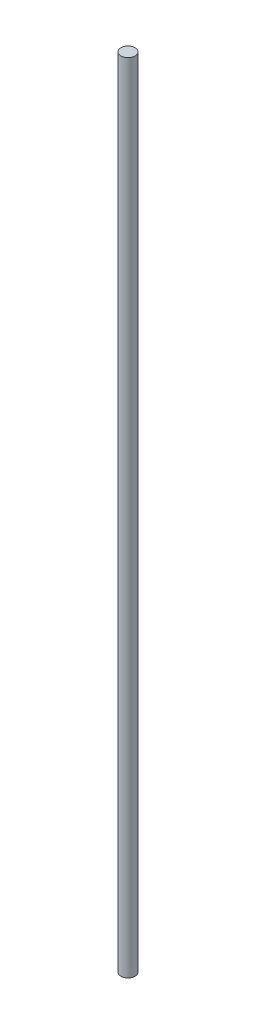
ISO-10303-21;
HEADER;
FILE_DESCRIPTION(('STEP AP214'),'2;1');
FILE_NAME('part.step','',(''),(''),'','','');
FILE_SCHEMA(('AUTOMOTIVE_DESIGN { 1 0 10303 214 1 1 1 1 }'));
ENDSEC;
DATA;
#1=APPLICATION_CONTEXT('core data for automotive mechanical design processes');
#2=APPLICATION_PROTOCOL_DEFINITION('international standard','automotive_design',2000,#1);
#3=PRODUCT_CONTEXT('',#1,'mechanical');
#4=PRODUCT('Part','Part','',(#3));
#5=PRODUCT_RELATED_PRODUCT_CATEGORY('part','',(#4));
#6=PRODUCT_DEFINITION_FORMATION('','',#4);
#7=PRODUCT_DEFINITION_CONTEXT('part definition',#1,'design');
#8=PRODUCT_DEFINITION('design','',#6,#7);
#9=PRODUCT_DEFINITION_SHAPE('','',#8);
#10=(LENGTH_UNIT() NAMED_UNIT(*) SI_UNIT(.MILLI.,.METRE.));
#11=(NAMED_UNIT(*) PLANE_ANGLE_UNIT() SI_UNIT($,.RADIAN.));
#12=(NAMED_UNIT(*) SI_UNIT($,.STERADIAN.) SOLID_ANGLE_UNIT());
#13=UNCERTAINTY_MEASURE_WITH_UNIT(LENGTH_MEASURE(1.E-05),#10,'distance_accuracy_value','');
#14=(GEOMETRIC_REPRESENTATION_CONTEXT(3) GLOBAL_UNCERTAINTY_ASSIGNED_CONTEXT((#13)) GLOBAL_UNIT_ASSIGNED_CONTEXT((#10,
#11,#12)) REPRESENTATION_CONTEXT('',''));
#15=CARTESIAN_POINT('',(0.,0.,0.));
#16=DIRECTION('',(0.,0.,1.));
#17=DIRECTION('',(1.,0.,0.));
#18=AXIS2_PLACEMENT_3D('',#15,#16,#17);
#19=CARTESIAN_POINT('',(0.,279.4,0.));
#20=DIRECTION('',(0.,-1.,0.));
#21=DIRECTION('',(0.,0.,-1.));
#22=AXIS2_PLACEMENT_3D('',#19,#20,#21);
#23=CYLINDRICAL_SURFACE('',#22,2.5);
#24=CARTESIAN_POINT('',(0.,279.4,0.));
#25=DIRECTION('',(0.,1.,0.));
#26=DIRECTION('',(0.,0.,1.));
#27=AXIS2_PLACEMENT_3D('',#24,#25,#26);
#28=CIRCLE('',#27,2.5);
#29=CARTESIAN_POINT('',(0.,279.4,2.5));
#30=VERTEX_POINT('',#29);
#31=EDGE_CURVE('E10',#30,#30,#28,.T.);
#32=ORIENTED_EDGE('',*,*,#31,.F.);
#33=EDGE_LOOP('',(#32));
#34=FACE_BOUND('',#33,.T.);
#35=CARTESIAN_POINT('',(0.,0.,0.));
#36=DIRECTION('',(0.,1.,0.));
#37=DIRECTION('',(0.,0.,1.));
#38=AXIS2_PLACEMENT_3D('',#35,#36,#37);
#39=CIRCLE('',#38,2.5);
#40=CARTESIAN_POINT('',(0.,0.,2.5));
#41=VERTEX_POINT('',#40);
#42=EDGE_CURVE('E35',#41,#41,#39,.T.);
#43=ORIENTED_EDGE('',*,*,#42,.T.);
#44=EDGE_LOOP('',(#43));
#45=FACE_BOUND('',#44,.T.);
#46=ADVANCED_FACE('F32',(#34,#45),#23,.T.);
#47=CARTESIAN_POINT('',(0.,279.4,0.));
#48=DIRECTION('',(0.,1.,0.));
#49=DIRECTION('',(0.,0.,1.));
#50=AXIS2_PLACEMENT_3D('',#47,#48,#49);
#51=PLANE('',#50);
#52=ORIENTED_EDGE('',*,*,#31,.T.);
#53=EDGE_LOOP('',(#52));
#54=FACE_BOUND('',#53,.T.);
#55=ADVANCED_FACE('F47',(#54),#51,.T.);
#56=CARTESIAN_POINT('',(0.,0.,0.));
#57=DIRECTION('',(0.,1.,0.));
#58=DIRECTION('',(0.,0.,1.));
#59=AXIS2_PLACEMENT_3D('',#56,#57,#58);
#60=PLANE('',#59);
#61=ORIENTED_EDGE('',*,*,#42,.F.);
#62=EDGE_LOOP('',(#61));
#63=FACE_BOUND('',#62,.T.);
#64=ADVANCED_FACE('F45',(#63),#60,.F.);
#65=CLOSED_SHELL('',(#46,#55,#64));
#66=MANIFOLD_SOLID_BREP('B2',#65);
#67=ADVANCED_BREP_SHAPE_REPRESENTATION('',(#18,#66),#14);
#68=SHAPE_DEFINITION_REPRESENTATION(#9,#67);
ENDSEC;
END-ISO-10303-21;
